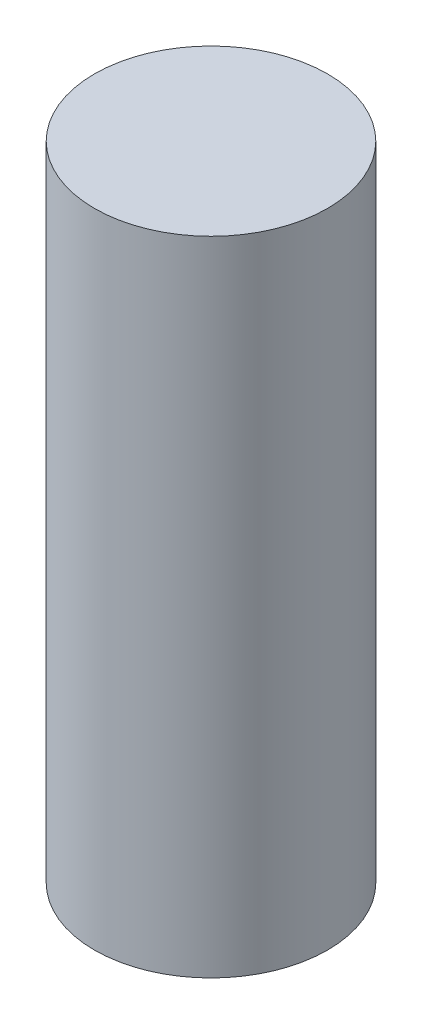
ISO-10303-21;
HEADER;
FILE_DESCRIPTION(('STEP AP214'),'2;1');
FILE_NAME('part.step','',(''),(''),'','','');
FILE_SCHEMA(('AUTOMOTIVE_DESIGN { 1 0 10303 214 1 1 1 1 }'));
ENDSEC;
DATA;
#1=APPLICATION_CONTEXT('core data for automotive mechanical design processes');
#2=APPLICATION_PROTOCOL_DEFINITION('international standard','automotive_design',2000,#1);
#3=PRODUCT_CONTEXT('',#1,'mechanical');
#4=PRODUCT('Part','Part','',(#3));
#5=PRODUCT_RELATED_PRODUCT_CATEGORY('part','',(#4));
#6=PRODUCT_DEFINITION_FORMATION('','',#4);
#7=PRODUCT_DEFINITION_CONTEXT('part definition',#1,'design');
#8=PRODUCT_DEFINITION('design','',#6,#7);
#9=PRODUCT_DEFINITION_SHAPE('','',#8);
#10=(LENGTH_UNIT() NAMED_UNIT(*) SI_UNIT(.MILLI.,.METRE.));
#11=(NAMED_UNIT(*) PLANE_ANGLE_UNIT() SI_UNIT($,.RADIAN.));
#12=(NAMED_UNIT(*) SI_UNIT($,.STERADIAN.) SOLID_ANGLE_UNIT());
#13=UNCERTAINTY_MEASURE_WITH_UNIT(LENGTH_MEASURE(1.E-05),#10,'distance_accuracy_value','');
#14=(GEOMETRIC_REPRESENTATION_CONTEXT(3) GLOBAL_UNCERTAINTY_ASSIGNED_CONTEXT((#13)) GLOBAL_UNIT_ASSIGNED_CONTEXT((#10,
#11,#12)) REPRESENTATION_CONTEXT('',''));
#15=CARTESIAN_POINT('',(0.,0.,0.));
#16=DIRECTION('',(0.,0.,1.));
#17=DIRECTION('',(1.,0.,0.));
#18=AXIS2_PLACEMENT_3D('',#15,#16,#17);
#19=CARTESIAN_POINT('',(0.,0.,0.));
#20=DIRECTION('',(0.,1.,0.));
#21=DIRECTION('',(0.,0.,1.));
#22=AXIS2_PLACEMENT_3D('',#19,#20,#21);
#23=PLANE('',#22);
#24=CARTESIAN_POINT('',(0.,0.,0.));
#25=DIRECTION('',(0.,1.,0.));
#26=DIRECTION('',(0.,0.,1.));
#27=AXIS2_PLACEMENT_3D('',#24,#25,#26);
#28=CIRCLE('',#27,6.35);
#29=CARTESIAN_POINT('',(0.,0.,6.35));
#30=VERTEX_POINT('',#29);
#31=EDGE_CURVE('E39',#30,#30,#28,.T.);
#32=ORIENTED_EDGE('',*,*,#31,.F.);
#33=EDGE_LOOP('',(#32));
#34=FACE_BOUND('',#33,.T.);
#35=CARTESIAN_POINT('',(0.,0.,0.));
#36=DIRECTION('',(0.,1.,0.));
#37=DIRECTION('',(0.,0.,1.));
#38=AXIS2_PLACEMENT_3D('',#35,#36,#37);
#39=CIRCLE('',#38,3.);
#40=CARTESIAN_POINT('',(0.,0.,3.));
#41=VERTEX_POINT('',#40);
#42=EDGE_CURVE('E49',#41,#41,#39,.T.);
#43=ORIENTED_EDGE('',*,*,#42,.T.);
#44=EDGE_LOOP('',(#43));
#45=FACE_BOUND('',#44,.T.);
#46=ADVANCED_FACE('F35',(#34,#45),#23,.F.);
#47=CARTESIAN_POINT('',(0.,35.,0.));
#48=DIRECTION('',(0.,-1.,0.));
#49=DIRECTION('',(0.,0.,-1.));
#50=AXIS2_PLACEMENT_3D('',#47,#48,#49);
#51=CYLINDRICAL_SURFACE('',#50,6.35);
#52=CARTESIAN_POINT('',(0.,35.,0.));
#53=DIRECTION('',(0.,1.,0.));
#54=DIRECTION('',(0.,0.,1.));
#55=AXIS2_PLACEMENT_3D('',#52,#53,#54);
#56=CIRCLE('',#55,6.35);
#57=CARTESIAN_POINT('',(0.,35.,6.35));
#58=VERTEX_POINT('',#57);
#59=EDGE_CURVE('E10',#58,#58,#56,.T.);
#60=ORIENTED_EDGE('',*,*,#59,.F.);
#61=EDGE_LOOP('',(#60));
#62=FACE_BOUND('',#61,.T.);
#63=ORIENTED_EDGE('',*,*,#31,.T.);
#64=EDGE_LOOP('',(#63));
#65=FACE_BOUND('',#64,.T.);
#66=ADVANCED_FACE('F37',(#62,#65),#51,.T.);
#67=CARTESIAN_POINT('',(0.,35.,0.));
#68=DIRECTION('',(0.,1.,0.));
#69=DIRECTION('',(0.,0.,1.));
#70=AXIS2_PLACEMENT_3D('',#67,#68,#69);
#71=PLANE('',#70);
#72=ORIENTED_EDGE('',*,*,#59,.T.);
#73=EDGE_LOOP('',(#72));
#74=FACE_BOUND('',#73,.T.);
#75=ADVANCED_FACE('F66',(#74),#71,.T.);
#76=CARTESIAN_POINT('',(0.,10.,0.));
#77=DIRECTION('',(0.,-1.,0.));
#78=DIRECTION('',(0.,0.,-1.));
#79=AXIS2_PLACEMENT_3D('',#76,#77,#78);
#80=CYLINDRICAL_SURFACE('',#79,3.);
#81=CARTESIAN_POINT('',(0.,10.,0.));
#82=DIRECTION('',(0.,1.,0.));
#83=DIRECTION('',(0.,0.,1.));
#84=AXIS2_PLACEMENT_3D('',#81,#82,#83);
#85=CIRCLE('',#84,3.);
#86=CARTESIAN_POINT('',(0.,10.,3.));
#87=VERTEX_POINT('',#86);
#88=EDGE_CURVE('E47',#87,#87,#85,.T.);
#89=ORIENTED_EDGE('',*,*,#88,.T.);
#90=EDGE_LOOP('',(#89));
#91=FACE_BOUND('',#90,.T.);
#92=ORIENTED_EDGE('',*,*,#42,.F.);
#93=EDGE_LOOP('',(#92));
#94=FACE_BOUND('',#93,.T.);
#95=ADVANCED_FACE('F57',(#91,#94),#80,.F.);
#96=CARTESIAN_POINT('',(0.,10.,0.));
#97=DIRECTION('',(0.,1.,0.));
#98=DIRECTION('',(0.,0.,1.));
#99=AXIS2_PLACEMENT_3D('',#96,#97,#98);
#100=PLANE('',#99);
#101=ORIENTED_EDGE('',*,*,#88,.F.);
#102=EDGE_LOOP('',(#101));
#103=FACE_BOUND('',#102,.T.);
#104=ADVANCED_FACE('F60',(#103),#100,.F.);
#105=CLOSED_SHELL('',(#46,#66,#75,#95,#104));
#106=MANIFOLD_SOLID_BREP('B2',#105);
#107=ADVANCED_BREP_SHAPE_REPRESENTATION('',(#18,#106),#14);
#108=SHAPE_DEFINITION_REPRESENTATION(#9,#107);
ENDSEC;
END-ISO-10303-21;
